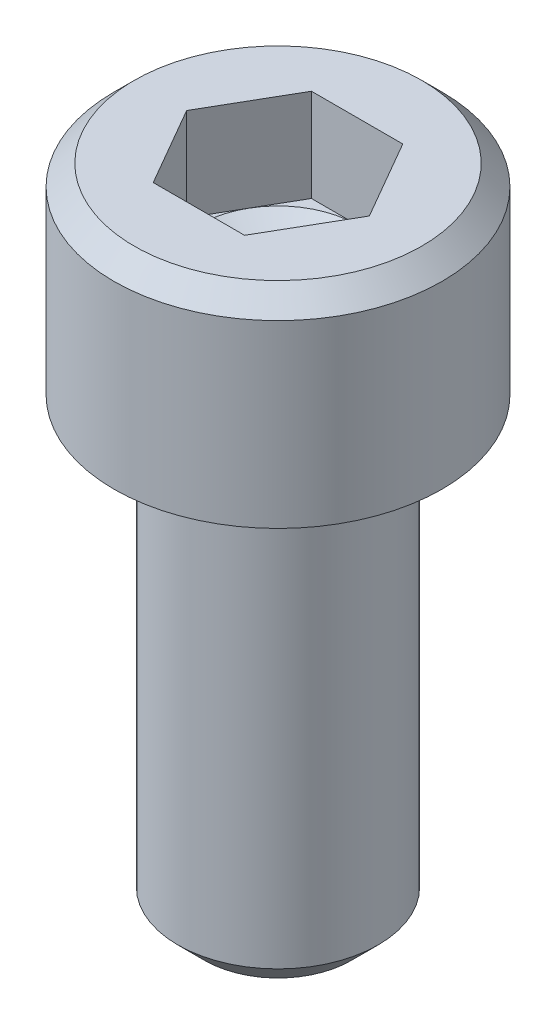
ISO-10303-21;
HEADER;
FILE_DESCRIPTION(('STEP AP214'),'2;1');
FILE_NAME('part.step','',(''),(''),'','','');
FILE_SCHEMA(('AUTOMOTIVE_DESIGN { 1 0 10303 214 1 1 1 1 }'));
ENDSEC;
DATA;
#1=APPLICATION_CONTEXT('core data for automotive mechanical design processes');
#2=APPLICATION_PROTOCOL_DEFINITION('international standard','automotive_design',2000,#1);
#3=PRODUCT_CONTEXT('',#1,'mechanical');
#4=PRODUCT('Part','Part','',(#3));
#5=PRODUCT_RELATED_PRODUCT_CATEGORY('part','',(#4));
#6=PRODUCT_DEFINITION_FORMATION('','',#4);
#7=PRODUCT_DEFINITION_CONTEXT('part definition',#1,'design');
#8=PRODUCT_DEFINITION('design','',#6,#7);
#9=PRODUCT_DEFINITION_SHAPE('','',#8);
#10=(LENGTH_UNIT() NAMED_UNIT(*) SI_UNIT(.MILLI.,.METRE.));
#11=(NAMED_UNIT(*) PLANE_ANGLE_UNIT() SI_UNIT($,.RADIAN.));
#12=(NAMED_UNIT(*) SI_UNIT($,.STERADIAN.) SOLID_ANGLE_UNIT());
#13=UNCERTAINTY_MEASURE_WITH_UNIT(LENGTH_MEASURE(1.E-05),#10,'distance_accuracy_value','');
#14=(GEOMETRIC_REPRESENTATION_CONTEXT(3) GLOBAL_UNCERTAINTY_ASSIGNED_CONTEXT((#13)) GLOBAL_UNIT_ASSIGNED_CONTEXT((#10,
#11,#12)) REPRESENTATION_CONTEXT('',''));
#15=CARTESIAN_POINT('',(0.,0.,0.));
#16=DIRECTION('',(0.,0.,1.));
#17=DIRECTION('',(1.,0.,0.));
#18=AXIS2_PLACEMENT_3D('',#15,#16,#17);
#19=CARTESIAN_POINT('',(0.,1.87960000005205,0.));
#20=DIRECTION('',(0.,1.,0.));
#21=DIRECTION('',(0.,0.,1.));
#22=AXIS2_PLACEMENT_3D('',#19,#20,#21);
#23=CONICAL_SURFACE('',#22,1.38430000009748,1.04719755120119);
#24=CARTESIAN_POINT('',(0.,1.08037402233663,5.6843418860808E-11));
#25=VERTEX_POINT('',#24);
#26=VERTEX_LOOP('',#25);
#27=FACE_BOUND('',#26,.T.);
#28=CARTESIAN_POINT('',(0.,1.87959999992078,0.));
#29=DIRECTION('',(0.,1.,0.));
#30=DIRECTION('',(0.,0.,1.));
#31=AXIS2_PLACEMENT_3D('',#28,#29,#30);
#32=CIRCLE('',#31,1.38429999987011);
#33=CARTESIAN_POINT('',(0.,1.87959999996039,-1.38429999993505));
#34=VERTEX_POINT('',#33);
#35=CARTESIAN_POINT('',(1.1988389664588,1.87959999996039,-0.692149999999999));
#36=VERTEX_POINT('',#35);
#37=EDGE_CURVE('E120',#34,#36,#32,.F.);
#38=ORIENTED_EDGE('',*,*,#37,.F.);
#39=CARTESIAN_POINT('',(0.,1.87959999998641,0.));
#40=DIRECTION('',(0.,1.,0.));
#41=DIRECTION('',(0.,0.,1.));
#42=AXIS2_PLACEMENT_3D('',#39,#40,#41);
#43=CIRCLE('',#42,1.3842999999838);
#44=CARTESIAN_POINT('',(-1.19883896645178,1.87959999999321,-0.692149999995951));
#45=VERTEX_POINT('',#44);
#46=EDGE_CURVE('E158',#45,#34,#43,.F.);
#47=ORIENTED_EDGE('',*,*,#46,.F.);
#48=CARTESIAN_POINT('',(0.,1.87959999998641,0.));
#49=DIRECTION('',(0.,1.,0.));
#50=DIRECTION('',(0.,0.,1.));
#51=AXIS2_PLACEMENT_3D('',#48,#49,#50);
#52=CIRCLE('',#51,1.3842999999838);
#53=CARTESIAN_POINT('',(-1.19883896645178,1.87960000001923,0.692149999995948));
#54=VERTEX_POINT('',#53);
#55=EDGE_CURVE('E155',#54,#45,#52,.F.);
#56=ORIENTED_EDGE('',*,*,#55,.F.);
#57=CARTESIAN_POINT('',(0.,1.87960000005205,0.));
#58=DIRECTION('',(0.,1.,0.));
#59=DIRECTION('',(0.,0.,1.));
#60=AXIS2_PLACEMENT_3D('',#57,#58,#59);
#61=CIRCLE('',#60,1.38430000009748);
#62=CARTESIAN_POINT('',(0.,1.87960000001923,1.38430000004064));
#63=VERTEX_POINT('',#62);
#64=EDGE_CURVE('E99',#63,#54,#61,.F.);
#65=ORIENTED_EDGE('',*,*,#64,.F.);
#66=CARTESIAN_POINT('',(0.,1.87959999998641,0.));
#67=DIRECTION('',(0.,1.,0.));
#68=DIRECTION('',(0.,0.,1.));
#69=AXIS2_PLACEMENT_3D('',#66,#67,#68);
#70=CIRCLE('',#69,1.3842999999838);
#71=CARTESIAN_POINT('',(1.19883896645178,1.87959999999321,0.692149999995949));
#72=VERTEX_POINT('',#71);
#73=EDGE_CURVE('E93',#72,#63,#70,.F.);
#74=ORIENTED_EDGE('',*,*,#73,.F.);
#75=CARTESIAN_POINT('',(0.,1.87959999998641,0.));
#76=DIRECTION('',(0.,1.,0.));
#77=DIRECTION('',(0.,0.,1.));
#78=AXIS2_PLACEMENT_3D('',#75,#76,#77);
#79=CIRCLE('',#78,1.3842999999838);
#80=EDGE_CURVE('E96',#36,#72,#79,.F.);
#81=ORIENTED_EDGE('',*,*,#80,.F.);
#82=EDGE_LOOP('',(#38,#47,#56,#65,#74,#81));
#83=FACE_BOUND('',#82,.T.);
#84=ADVANCED_FACE('F15',(#27,#83),#23,.F.);
#85=CARTESIAN_POINT('',(0.,1.8796,0.));
#86=DIRECTION('',(0.,1.,0.));
#87=DIRECTION('',(0.,0.,1.));
#88=AXIS2_PLACEMENT_3D('',#85,#86,#87);
#89=PLANE('',#88);
#90=DIRECTION('',(0.5,0.,-0.866025403784438));
#91=VECTOR('',#90,1.);
#92=CARTESIAN_POINT('',(0.799225977639199,1.8796,1.3843));
#93=LINE('',#92,#91);
#94=CARTESIAN_POINT('',(0.799225977639199,1.8796,1.3843));
#95=VERTEX_POINT('',#94);
#96=EDGE_CURVE('E105',#95,#72,#93,.T.);
#97=ORIENTED_EDGE('',*,*,#96,.T.);
#98=ORIENTED_EDGE('',*,*,#73,.T.);
#99=DIRECTION('',(1.,0.,0.));
#100=VECTOR('',#99,1.);
#101=CARTESIAN_POINT('',(-0.799225977639198,1.8796,1.3843));
#102=LINE('',#101,#100);
#103=EDGE_CURVE('E107',#63,#95,#102,.T.);
#104=ORIENTED_EDGE('',*,*,#103,.T.);
#105=EDGE_LOOP('',(#97,#98,#104));
#106=FACE_BOUND('',#105,.T.);
#107=ADVANCED_FACE('F106',(#106),#89,.T.);
#108=CARTESIAN_POINT('',(0.,1.8796,0.));
#109=DIRECTION('',(0.,1.,0.));
#110=DIRECTION('',(0.,0.,1.));
#111=AXIS2_PLACEMENT_3D('',#108,#109,#110);
#112=PLANE('',#111);
#113=DIRECTION('',(-0.499999999999999,0.,-0.866025403784439));
#114=VECTOR('',#113,1.);
#115=CARTESIAN_POINT('',(1.5984519552784,1.8796,0.));
#116=LINE('',#115,#114);
#117=CARTESIAN_POINT('',(1.5984519552784,1.8796,0.));
#118=VERTEX_POINT('',#117);
#119=EDGE_CURVE('E118',#118,#36,#116,.T.);
#120=ORIENTED_EDGE('',*,*,#119,.T.);
#121=ORIENTED_EDGE('',*,*,#80,.T.);
#122=DIRECTION('',(0.5,0.,-0.866025403784438));
#123=VECTOR('',#122,1.);
#124=CARTESIAN_POINT('',(0.799225977639199,1.8796,1.3843));
#125=LINE('',#124,#123);
#126=EDGE_CURVE('E112',#72,#118,#125,.T.);
#127=ORIENTED_EDGE('',*,*,#126,.T.);
#128=EDGE_LOOP('',(#120,#121,#127));
#129=FACE_BOUND('',#128,.T.);
#130=ADVANCED_FACE('F115',(#129),#112,.T.);
#131=CARTESIAN_POINT('',(0.,1.8796,0.));
#132=DIRECTION('',(0.,1.,0.));
#133=DIRECTION('',(0.,0.,1.));
#134=AXIS2_PLACEMENT_3D('',#131,#132,#133);
#135=PLANE('',#134);
#136=DIRECTION('',(-1.,0.,0.));
#137=VECTOR('',#136,1.);
#138=CARTESIAN_POINT('',(0.799225977639201,1.8796,-1.3843));
#139=LINE('',#138,#137);
#140=CARTESIAN_POINT('',(0.799225977639201,1.8796,-1.3843));
#141=VERTEX_POINT('',#140);
#142=EDGE_CURVE('E168',#141,#34,#139,.T.);
#143=ORIENTED_EDGE('',*,*,#142,.T.);
#144=ORIENTED_EDGE('',*,*,#37,.T.);
#145=DIRECTION('',(-0.499999999999999,0.,-0.866025403784439));
#146=VECTOR('',#145,1.);
#147=CARTESIAN_POINT('',(1.5984519552784,1.8796,0.));
#148=LINE('',#147,#146);
#149=EDGE_CURVE('E165',#36,#141,#148,.T.);
#150=ORIENTED_EDGE('',*,*,#149,.T.);
#151=EDGE_LOOP('',(#143,#144,#150));
#152=FACE_BOUND('',#151,.T.);
#153=ADVANCED_FACE('F164',(#152),#135,.T.);
#154=CARTESIAN_POINT('',(0.,1.8796,0.));
#155=DIRECTION('',(0.,1.,0.));
#156=DIRECTION('',(0.,0.,1.));
#157=AXIS2_PLACEMENT_3D('',#154,#155,#156);
#158=PLANE('',#157);
#159=DIRECTION('',(-0.5,0.,0.866025403784438));
#160=VECTOR('',#159,1.);
#161=CARTESIAN_POINT('',(-0.799225977639196,1.8796,-1.3843));
#162=LINE('',#161,#160);
#163=CARTESIAN_POINT('',(-0.799225977639196,1.8796,-1.3843));
#164=VERTEX_POINT('',#163);
#165=EDGE_CURVE('E183',#164,#45,#162,.T.);
#166=ORIENTED_EDGE('',*,*,#165,.T.);
#167=ORIENTED_EDGE('',*,*,#46,.T.);
#168=DIRECTION('',(-1.,0.,0.));
#169=VECTOR('',#168,1.);
#170=CARTESIAN_POINT('',(0.799225977639201,1.8796,-1.3843));
#171=LINE('',#170,#169);
#172=EDGE_CURVE('E184',#34,#164,#171,.T.);
#173=ORIENTED_EDGE('',*,*,#172,.T.);
#174=EDGE_LOOP('',(#166,#167,#173));
#175=FACE_BOUND('',#174,.T.);
#176=ADVANCED_FACE('F328',(#175),#158,.T.);
#177=CARTESIAN_POINT('',(0.,1.8796,0.));
#178=DIRECTION('',(0.,1.,0.));
#179=DIRECTION('',(0.,0.,1.));
#180=AXIS2_PLACEMENT_3D('',#177,#178,#179);
#181=PLANE('',#180);
#182=DIRECTION('',(0.5,0.,0.866025403784439));
#183=VECTOR('',#182,1.);
#184=CARTESIAN_POINT('',(-1.5984519552784,1.8796,0.));
#185=LINE('',#184,#183);
#186=CARTESIAN_POINT('',(-1.5984519552784,1.8796,0.));
#187=VERTEX_POINT('',#186);
#188=EDGE_CURVE('E196',#187,#54,#185,.T.);
#189=ORIENTED_EDGE('',*,*,#188,.T.);
#190=ORIENTED_EDGE('',*,*,#55,.T.);
#191=DIRECTION('',(-0.5,0.,0.866025403784438));
#192=VECTOR('',#191,1.);
#193=CARTESIAN_POINT('',(-0.799225977639196,1.8796,-1.3843));
#194=LINE('',#193,#192);
#195=EDGE_CURVE('E197',#45,#187,#194,.T.);
#196=ORIENTED_EDGE('',*,*,#195,.T.);
#197=EDGE_LOOP('',(#189,#190,#196));
#198=FACE_BOUND('',#197,.T.);
#199=ADVANCED_FACE('F324',(#198),#181,.T.);
#200=CARTESIAN_POINT('',(0.,1.8796,0.));
#201=DIRECTION('',(0.,1.,0.));
#202=DIRECTION('',(0.,0.,1.));
#203=AXIS2_PLACEMENT_3D('',#200,#201,#202);
#204=PLANE('',#203);
#205=DIRECTION('',(1.,0.,0.));
#206=VECTOR('',#205,1.);
#207=CARTESIAN_POINT('',(-0.799225977639198,1.8796,1.3843));
#208=LINE('',#207,#206);
#209=CARTESIAN_POINT('',(-0.799225977639198,1.8796,1.3843));
#210=VERTEX_POINT('',#209);
#211=EDGE_CURVE('E139',#210,#63,#208,.T.);
#212=ORIENTED_EDGE('',*,*,#211,.T.);
#213=ORIENTED_EDGE('',*,*,#64,.T.);
#214=DIRECTION('',(0.5,0.,0.866025403784439));
#215=VECTOR('',#214,1.);
#216=CARTESIAN_POINT('',(-1.5984519552784,1.8796,0.));
#217=LINE('',#216,#215);
#218=EDGE_CURVE('E215',#54,#210,#217,.T.);
#219=ORIENTED_EDGE('',*,*,#218,.T.);
#220=EDGE_LOOP('',(#212,#213,#219));
#221=FACE_BOUND('',#220,.T.);
#222=ADVANCED_FACE('F320',(#221),#204,.T.);
#223=CARTESIAN_POINT('',(-0.799225977639198,3.5052,1.3843));
#224=DIRECTION('',(0.,0.,1.));
#225=DIRECTION('',(1.,0.,0.));
#226=AXIS2_PLACEMENT_3D('',#223,#224,#225);
#227=PLANE('',#226);
#228=DIRECTION('',(1.,0.,0.));
#229=VECTOR('',#228,1.);
#230=CARTESIAN_POINT('',(0.,3.5052,1.3843));
#231=LINE('',#230,#229);
#232=CARTESIAN_POINT('',(-0.799225977639198,3.5052,1.3843));
#233=VERTEX_POINT('',#232);
#234=CARTESIAN_POINT('',(0.799225977639199,3.5052,1.3843));
#235=VERTEX_POINT('',#234);
#236=EDGE_CURVE('E210',#233,#235,#231,.T.);
#237=ORIENTED_EDGE('',*,*,#236,.T.);
#238=DIRECTION('',(0.,1.,0.));
#239=VECTOR('',#238,1.);
#240=CARTESIAN_POINT('',(0.799225977639199,3.5052,1.3843));
#241=LINE('',#240,#239);
#242=EDGE_CURVE('E125',#235,#95,#241,.F.);
#243=ORIENTED_EDGE('',*,*,#242,.T.);
#244=ORIENTED_EDGE('',*,*,#103,.F.);
#245=ORIENTED_EDGE('',*,*,#211,.F.);
#246=DIRECTION('',(0.,1.,0.));
#247=VECTOR('',#246,1.);
#248=CARTESIAN_POINT('',(-0.799225977639198,3.5052,1.3843));
#249=LINE('',#248,#247);
#250=EDGE_CURVE('E211',#210,#233,#249,.T.);
#251=ORIENTED_EDGE('',*,*,#250,.T.);
#252=EDGE_LOOP('',(#237,#243,#244,#245,#251));
#253=FACE_BOUND('',#252,.T.);
#254=ADVANCED_FACE('F317',(#253),#227,.F.);
#255=CARTESIAN_POINT('',(0.799225977639199,3.5052,1.3843));
#256=DIRECTION('',(0.866025403784438,0.,0.5));
#257=DIRECTION('',(0.5,0.,-0.866025403784438));
#258=AXIS2_PLACEMENT_3D('',#255,#256,#257);
#259=PLANE('',#258);
#260=DIRECTION('',(0.5,0.,-0.866025403784438));
#261=VECTOR('',#260,1.);
#262=CARTESIAN_POINT('',(0.799225977639199,3.5052,1.3843));
#263=LINE('',#262,#261);
#264=CARTESIAN_POINT('',(1.5984519552784,3.5052,0.));
#265=VERTEX_POINT('',#264);
#266=EDGE_CURVE('E227',#235,#265,#263,.T.);
#267=ORIENTED_EDGE('',*,*,#266,.T.);
#268=DIRECTION('',(0.,1.,0.));
#269=VECTOR('',#268,1.);
#270=CARTESIAN_POINT('',(1.5984519552784,3.5052,0.));
#271=LINE('',#270,#269);
#272=EDGE_CURVE('E124',#265,#118,#271,.F.);
#273=ORIENTED_EDGE('',*,*,#272,.T.);
#274=ORIENTED_EDGE('',*,*,#126,.F.);
#275=ORIENTED_EDGE('',*,*,#96,.F.);
#276=ORIENTED_EDGE('',*,*,#242,.F.);
#277=EDGE_LOOP('',(#267,#273,#274,#275,#276));
#278=FACE_BOUND('',#277,.T.);
#279=ADVANCED_FACE('F122',(#278),#259,.F.);
#280=CARTESIAN_POINT('',(1.5984519552784,3.5052,0.));
#281=DIRECTION('',(0.866025403784439,0.,-0.499999999999999));
#282=DIRECTION('',(-0.499999999999999,0.,-0.866025403784439));
#283=AXIS2_PLACEMENT_3D('',#280,#281,#282);
#284=PLANE('',#283);
#285=DIRECTION('',(-0.499999999999999,0.,-0.866025403784439));
#286=VECTOR('',#285,1.);
#287=CARTESIAN_POINT('',(1.5984519552784,3.5052,0.));
#288=LINE('',#287,#286);
#289=CARTESIAN_POINT('',(0.799225977639201,3.5052,-1.3843));
#290=VERTEX_POINT('',#289);
#291=EDGE_CURVE('E229',#265,#290,#288,.T.);
#292=ORIENTED_EDGE('',*,*,#291,.T.);
#293=DIRECTION('',(0.,1.,0.));
#294=VECTOR('',#293,1.);
#295=CARTESIAN_POINT('',(0.799225977639201,3.5052,-1.3843));
#296=LINE('',#295,#294);
#297=EDGE_CURVE('E172',#290,#141,#296,.F.);
#298=ORIENTED_EDGE('',*,*,#297,.T.);
#299=ORIENTED_EDGE('',*,*,#149,.F.);
#300=ORIENTED_EDGE('',*,*,#119,.F.);
#301=ORIENTED_EDGE('',*,*,#272,.F.);
#302=EDGE_LOOP('',(#292,#298,#299,#300,#301));
#303=FACE_BOUND('',#302,.T.);
#304=ADVANCED_FACE('F170',(#303),#284,.F.);
#305=CARTESIAN_POINT('',(0.799225977639201,3.5052,-1.3843));
#306=DIRECTION('',(0.,0.,-1.));
#307=DIRECTION('',(-1.,0.,0.));
#308=AXIS2_PLACEMENT_3D('',#305,#306,#307);
#309=PLANE('',#308);
#310=DIRECTION('',(1.,0.,0.));
#311=VECTOR('',#310,1.);
#312=CARTESIAN_POINT('',(0.,3.5052,-1.3843));
#313=LINE('',#312,#311);
#314=CARTESIAN_POINT('',(-0.799225977639196,3.5052,-1.3843));
#315=VERTEX_POINT('',#314);
#316=EDGE_CURVE('E231',#290,#315,#313,.F.);
#317=ORIENTED_EDGE('',*,*,#316,.T.);
#318=DIRECTION('',(0.,1.,0.));
#319=VECTOR('',#318,1.);
#320=CARTESIAN_POINT('',(-0.799225977639196,3.5052,-1.3843));
#321=LINE('',#320,#319);
#322=EDGE_CURVE('E193',#315,#164,#321,.F.);
#323=ORIENTED_EDGE('',*,*,#322,.T.);
#324=ORIENTED_EDGE('',*,*,#172,.F.);
#325=ORIENTED_EDGE('',*,*,#142,.F.);
#326=ORIENTED_EDGE('',*,*,#297,.F.);
#327=EDGE_LOOP('',(#317,#323,#324,#325,#326));
#328=FACE_BOUND('',#327,.T.);
#329=ADVANCED_FACE('F308',(#328),#309,.F.);
#330=CARTESIAN_POINT('',(-0.799225977639196,3.5052,-1.3843));
#331=DIRECTION('',(-0.866025403784438,0.,-0.5));
#332=DIRECTION('',(-0.5,0.,0.866025403784438));
#333=AXIS2_PLACEMENT_3D('',#330,#331,#332);
#334=PLANE('',#333);
#335=DIRECTION('',(-0.500000000000001,0.,0.866025403784438));
#336=VECTOR('',#335,1.);
#337=CARTESIAN_POINT('',(-0.799225977639196,3.5052,-1.3843));
#338=LINE('',#337,#336);
#339=CARTESIAN_POINT('',(-1.5984519552784,3.5052,0.));
#340=VERTEX_POINT('',#339);
#341=EDGE_CURVE('E233',#315,#340,#338,.T.);
#342=ORIENTED_EDGE('',*,*,#341,.T.);
#343=DIRECTION('',(0.,1.,0.));
#344=VECTOR('',#343,1.);
#345=CARTESIAN_POINT('',(-1.5984519552784,3.5052,0.));
#346=LINE('',#345,#344);
#347=EDGE_CURVE('E207',#340,#187,#346,.F.);
#348=ORIENTED_EDGE('',*,*,#347,.T.);
#349=ORIENTED_EDGE('',*,*,#195,.F.);
#350=ORIENTED_EDGE('',*,*,#165,.F.);
#351=ORIENTED_EDGE('',*,*,#322,.F.);
#352=EDGE_LOOP('',(#342,#348,#349,#350,#351));
#353=FACE_BOUND('',#352,.T.);
#354=ADVANCED_FACE('F304',(#353),#334,.F.);
#355=CARTESIAN_POINT('',(-1.5984519552784,3.5052,0.));
#356=DIRECTION('',(-0.866025403784439,0.,0.5));
#357=DIRECTION('',(0.5,0.,0.866025403784439));
#358=AXIS2_PLACEMENT_3D('',#355,#356,#357);
#359=PLANE('',#358);
#360=DIRECTION('',(0.5,0.,0.866025403784439));
#361=VECTOR('',#360,1.);
#362=CARTESIAN_POINT('',(-1.5984519552784,3.5052,0.));
#363=LINE('',#362,#361);
#364=EDGE_CURVE('E153',#340,#233,#363,.T.);
#365=ORIENTED_EDGE('',*,*,#364,.T.);
#366=ORIENTED_EDGE('',*,*,#250,.F.);
#367=ORIENTED_EDGE('',*,*,#218,.F.);
#368=ORIENTED_EDGE('',*,*,#188,.F.);
#369=ORIENTED_EDGE('',*,*,#347,.F.);
#370=EDGE_LOOP('',(#365,#366,#367,#368,#369));
#371=FACE_BOUND('',#370,.T.);
#372=ADVANCED_FACE('F300',(#371),#359,.F.);
#373=CARTESIAN_POINT('',(0.,3.5052,0.));
#374=DIRECTION('',(0.,-1.,0.));
#375=DIRECTION('',(0.,0.,-1.));
#376=AXIS2_PLACEMENT_3D('',#373,#374,#375);
#377=PLANE('',#376);
#378=ORIENTED_EDGE('',*,*,#341,.F.);
#379=ORIENTED_EDGE('',*,*,#316,.F.);
#380=ORIENTED_EDGE('',*,*,#291,.F.);
#381=ORIENTED_EDGE('',*,*,#266,.F.);
#382=ORIENTED_EDGE('',*,*,#236,.F.);
#383=ORIENTED_EDGE('',*,*,#364,.F.);
#384=EDGE_LOOP('',(#378,#379,#380,#381,#382,#383));
#385=FACE_BOUND('',#384,.T.);
#386=CARTESIAN_POINT('',(0.,3.50520000006327,0.));
#387=DIRECTION('',(0.,-1.,0.));
#388=DIRECTION('',(0.,0.,-1.));
#389=AXIS2_PLACEMENT_3D('',#386,#387,#388);
#390=CIRCLE('',#389,2.5145999999836);
#391=CARTESIAN_POINT('',(0.,3.50520000006327,-2.5145999999836));
#392=VERTEX_POINT('',#391);
#393=EDGE_CURVE('E150',#392,#392,#390,.T.);
#394=ORIENTED_EDGE('',*,*,#393,.F.);
#395=EDGE_LOOP('',(#394));
#396=FACE_BOUND('',#395,.T.);
#397=ADVANCED_FACE('F296',(#385,#396),#377,.F.);
#398=CARTESIAN_POINT('',(0.,3.14960000002884,0.));
#399=DIRECTION('',(0.,-1.,0.));
#400=DIRECTION('',(0.,0.,-1.));
#401=AXIS2_PLACEMENT_3D('',#398,#399,#400);
#402=CONICAL_SURFACE('',#401,2.87020000001803,0.785398163397448);
#403=CARTESIAN_POINT('',(0.,3.1496,0.));
#404=DIRECTION('',(0.,-1.,0.));
#405=DIRECTION('',(0.,0.,-1.));
#406=AXIS2_PLACEMENT_3D('',#403,#404,#405);
#407=CIRCLE('',#406,2.8702);
#408=CARTESIAN_POINT('',(0.,3.1496,-2.8702));
#409=VERTEX_POINT('',#408);
#410=EDGE_CURVE('E149',#409,#409,#407,.T.);
#411=ORIENTED_EDGE('',*,*,#410,.F.);
#412=EDGE_LOOP('',(#411));
#413=FACE_BOUND('',#412,.T.);
#414=ORIENTED_EDGE('',*,*,#393,.T.);
#415=EDGE_LOOP('',(#414));
#416=FACE_BOUND('',#415,.T.);
#417=ADVANCED_FACE('F292',(#413,#416),#402,.T.);
#418=CARTESIAN_POINT('',(0.,4.077335,0.));
#419=DIRECTION('',(0.,-1.,0.));
#420=DIRECTION('',(0.,0.,-1.));
#421=AXIS2_PLACEMENT_3D('',#418,#419,#420);
#422=CYLINDRICAL_SURFACE('',#421,2.8702);
#423=CARTESIAN_POINT('',(0.,0.,0.));
#424=DIRECTION('',(0.,-1.,0.));
#425=DIRECTION('',(0.,0.,-1.));
#426=AXIS2_PLACEMENT_3D('',#423,#424,#425);
#427=CIRCLE('',#426,2.8702);
#428=CARTESIAN_POINT('',(0.,0.,-2.8702));
#429=VERTEX_POINT('',#428);
#430=EDGE_CURVE('E146',#429,#429,#427,.T.);
#431=ORIENTED_EDGE('',*,*,#430,.F.);
#432=EDGE_LOOP('',(#431));
#433=FACE_BOUND('',#432,.T.);
#434=ORIENTED_EDGE('',*,*,#410,.T.);
#435=EDGE_LOOP('',(#434));
#436=FACE_BOUND('',#435,.T.);
#437=ADVANCED_FACE('F288',(#433,#436),#422,.T.);
#438=CARTESIAN_POINT('',(0.,-7.9375,0.));
#439=DIRECTION('',(0.,-1.,0.));
#440=DIRECTION('',(0.,0.,-1.));
#441=AXIS2_PLACEMENT_3D('',#438,#439,#440);
#442=PLANE('',#441);
#443=CARTESIAN_POINT('',(0.,-7.93750000002547,0.));
#444=DIRECTION('',(0.,1.,0.));
#445=DIRECTION('',(0.,0.,1.));
#446=AXIS2_PLACEMENT_3D('',#443,#444,#445);
#447=CIRCLE('',#446,1.28015999996478);
#448=CARTESIAN_POINT('',(0.,-7.93750000002547,1.28015999996478));
#449=VERTEX_POINT('',#448);
#450=EDGE_CURVE('E142',#449,#449,#447,.T.);
#451=ORIENTED_EDGE('',*,*,#450,.F.);
#452=EDGE_LOOP('',(#451));
#453=FACE_BOUND('',#452,.T.);
#454=ADVANCED_FACE('F277',(#453),#442,.T.);
#455=CARTESIAN_POINT('',(0.,0.,0.));
#456=DIRECTION('',(0.,-1.,0.));
#457=DIRECTION('',(0.,0.,-1.));
#458=AXIS2_PLACEMENT_3D('',#455,#456,#457);
#459=PLANE('',#458);
#460=CARTESIAN_POINT('',(-2.0066,0.,0.));
#461=CARTESIAN_POINT('',(-2.00657674795477,-1.02987322868103E-09,-0.0210535453836888));
#462=CARTESIAN_POINT('',(-2.00622815317092,-3.28270234331897E-09,-0.0421067214151488));
#463=CARTESIAN_POINT('',(-2.0048811989517,-7.11117959561256E-09,-0.0841913443053813));
#464=CARTESIAN_POINT('',(-2.00388286833117,-8.68685775877969E-09,-0.105222792086344));
#465=CARTESIAN_POINT('',(-2.00123739445825,-8.03859394237303E-09,-0.147244308043756));
#466=CARTESIAN_POINT('',(-1.99959026759685,-5.81474794807904E-09,-0.16823437725212));
#467=CARTESIAN_POINT('',(-1.99564844990729,-9.30315128877116E-10,-0.210153505177709));
#468=CARTESIAN_POINT('',(-1.99335376308009,1.73026899760534E-09,-0.231082564271078));
#469=CARTESIAN_POINT('',(-1.98812042069833,-3.30203769784527E-09,-0.272860201859723));
#470=CARTESIAN_POINT('',(-1.98518175683406,-1.09950621266378E-08,-0.293708779312952));
#471=CARTESIAN_POINT('',(-1.97865784703102,-4.46982791273633E-08,-0.335305664420834));
#472=CARTESIAN_POINT('',(-1.97507258041409,-7.07090575725484E-08,-0.356053968846992));
#473=CARTESIAN_POINT('',(-1.97020152960264,-1.42926104478227E-07,-0.381914968927608));
#474=CARTESIAN_POINT('',(-1.96920779513382,-1.59355672164636E-07,-0.387083706135684));
#475=CARTESIAN_POINT('',(-1.96663693460487,-1.90968976662609E-07,-0.400125398277151));
#476=CARTESIAN_POINT('',(-1.96502766009135,-2.00960847295408E-07,-0.407992049031747));
#477=CARTESIAN_POINT('',(-1.95960284683241,-2.18405370153509E-07,-0.433667817878984));
#478=CARTESIAN_POINT('',(-1.95557776885798,-2.06564595586332E-07,-0.451432732885808));
#479=CARTESIAN_POINT('',(-1.94502916466347,-1.71278707842198E-07,-0.495186172860747));
#480=CARTESIAN_POINT('',(-1.93822180607698,-1.44994717166113E-07,-0.521106969519364));
#481=CARTESIAN_POINT('',(-1.92754178238934,-1.06622923101906E-07,-0.558669722683704));
#482=CARTESIAN_POINT('',(-1.92408017493624,-9.45682034763325E-08,-0.570430290676044));
#483=CARTESIAN_POINT('',(-1.91443920677518,-6.47820304016461E-08,-0.602108687273396));
#484=CARTESIAN_POINT('',(-1.90805591894326,-4.89958367324419E-08,-0.62196489634165));
#485=CARTESIAN_POINT('',(-1.89322696195701,-2.16570692512158E-08,-0.6657440113875));
#486=CARTESIAN_POINT('',(-1.88463391007707,-1.17598048123285E-08,-0.689617144636188));
#487=CARTESIAN_POINT('',(-1.87005888082923,-2.75229019226935E-09,-0.727821938101784));
#488=CARTESIAN_POINT('',(-1.86435762946484,-9.46506409186385E-10,-0.742261311004643));
#489=CARTESIAN_POINT('',(-1.8569571643915,-1.98452065742484E-10,-0.760403034197268));
#490=CARTESIAN_POINT('',(-1.85540869056698,-1.26458943328944E-10,-0.764167166905696));
#491=CARTESIAN_POINT('',(-1.84982143640068,4.47138408935015E-11,-0.777638146790325));
#492=CARTESIAN_POINT('',(-1.84572094640862,6.5112002128641E-12,-0.787319460403763));
#493=CARTESIAN_POINT('',(-1.83319343018424,-1.58719486001751E-11,-0.8162650256954));
#494=CARTESIAN_POINT('',(-1.82453998858113,9.2159889624457E-11,-0.835431833552913));
#495=CARTESIAN_POINT('',(-1.80664368504906,-3.34783013206927E-10,-0.873487528804415));
#496=CARTESIAN_POINT('',(-1.79740083080505,-8.69749372256401E-10,-0.892376419818028));
#497=CARTESIAN_POINT('',(-1.7783327671823,-5.28964813308161E-09,-0.929858040522434));
#498=CARTESIAN_POINT('',(-1.76850755818313,-9.17457835141041E-09,-0.948450770406252));
#499=CARTESIAN_POINT('',(-1.74828526439013,-2.69615032211072E-08,-0.985322860463001));
#500=CARTESIAN_POINT('',(-1.73788817288871,-4.08636153865207E-08,-1.0036022169571));
#501=CARTESIAN_POINT('',(-1.71652929081971,-8.19274780316847E-08,-1.03982855952264));
#502=CARTESIAN_POINT('',(-1.70556748664128,-1.09089548239784E-07,-1.05777553756884));
#503=CARTESIAN_POINT('',(-1.68590779857202,-1.92038538961032E-07,-1.08888228104149));
#504=CARTESIAN_POINT('',(-1.67732893012993,-2.38973155826874E-07,-1.10211731605582));
#505=CARTESIAN_POINT('',(-1.66737397427836,-2.85569048380499E-07,-1.11706811636007));
#506=CARTESIAN_POINT('',(-1.66615644540053,-2.91137025433598E-07,-1.11888988203999));
#507=CARTESIAN_POINT('',(-1.65710976800061,-3.251492220666E-07,-1.13236982426601));
#508=CARTESIAN_POINT('',(-1.64913968443748,-3.14428699606279E-07,-1.14393364142148));
#509=CARTESIAN_POINT('',(-1.6280889475509,-2.78775875892855E-07,-1.17379137340659));
#510=CARTESIAN_POINT('',(-1.61481719150915,-2.49174101557778E-07,-1.19195073228609));
#511=CARTESIAN_POINT('',(-1.58517803272265,-1.78799760062337E-07,-1.23108761543351));
#512=CARTESIAN_POINT('',(-1.56868858527346,-1.36974271482056E-07,-1.25197272345078));
#513=CARTESIAN_POINT('',(-1.53110609367447,-6.28657621700323E-08,-1.29767441875975));
#514=CARTESIAN_POINT('',(-1.50980913790186,-3.48180722527908E-08,-1.32232388307862));
#515=CARTESIAN_POINT('',(-1.47408305247002,-8.75549677614937E-09,-1.3617026947383));
#516=CARTESIAN_POINT('',(-1.46000368172331,-3.49436515205118E-09,-1.37675104820152));
#517=CARTESIAN_POINT('',(-1.43684471589307,-1.06894253846871E-10,-1.4007647105988));
#518=CARTESIAN_POINT('',(-1.42790344032393,-2.62057990142239E-11,-1.40986373433866));
#519=CARTESIAN_POINT('',(-1.40400254483371,3.30191074214384E-11,-1.43374286826482));
#520=CARTESIAN_POINT('',(-1.38890017677361,-8.86190779095147E-11,-1.44838068566973));
#521=CARTESIAN_POINT('',(-1.35824599394922,3.53217776602966E-12,-1.4771769584308));
#522=CARTESIAN_POINT('',(-1.34269418779438,2.17315197602431E-10,-1.4913354229582));
#523=CARTESIAN_POINT('',(-1.31115938241099,-1.31940176197063E-09,-1.51916354734923));
#524=CARTESIAN_POINT('',(-1.29517638607931,-3.06988854801023E-09,-1.53283321049533));
#525=CARTESIAN_POINT('',(-1.26279328654894,-1.24287031660242E-08,-1.5596694338315));
#526=CARTESIAN_POINT('',(-1.24639318096924,-2.00370644439671E-08,-1.57283599114859));
#527=CARTESIAN_POINT('',(-1.21319259449835,-5.00092750128227E-08,-1.59865472137272));
#528=CARTESIAN_POINT('',(-1.19639210635177,-7.23733918908186E-08,-1.61130688494712));
#529=CARTESIAN_POINT('',(-1.1624033797944,-1.33475399336209E-07,-1.63608113370562));
#530=CARTESIAN_POINT('',(-1.14521512955012,-1.72213790245397E-07,-1.64820320267937));
#531=CARTESIAN_POINT('',(-1.12350556118374,-2.5590939186804E-07,-1.66302548597681));
#532=CARTESIAN_POINT('',(-1.11915222956514,-2.74413149122719E-07,-1.66597356454396));
#533=CARTESIAN_POINT('',(-1.10795992564871,-3.08826135172452E-07,-1.67347764496279));
#534=CARTESIAN_POINT('',(-1.10110136235172,-3.1740997760186E-07,-1.67800449102467));
#535=CARTESIAN_POINT('',(-1.07888494827042,-3.26316941285496E-07,-1.69245925418981));
#536=CARTESIAN_POINT('',(-1.06341063498823,-3.03628853977139E-07,-1.70220830679274));
#537=CARTESIAN_POINT('',(-1.02504900254242,-2.42168185231604E-07,-1.72564219322325));
#538=CARTESIAN_POINT('',(-1.00201272848581,-2.007882217182E-07,-1.73908443143617));
#539=CARTESIAN_POINT('',(-0.968094573341908,-1.43447944507211E-07,-1.75797313042803));
#540=CARTESIAN_POINT('',(-0.95741783300332,-1.25904961339837E-07,-1.76379131985225));
#541=CARTESIAN_POINT('',(-0.929427155169496,-8.45679112686229E-08,-1.77871595587886));
#542=CARTESIAN_POINT('',(-0.912030276427905,-6.34716592759383E-08,-1.78766750581178));
#543=CARTESIAN_POINT('',(-0.872411014853843,-2.66966733465684E-08,-1.80732900871362));
#544=CARTESIAN_POINT('',(-0.850113762049958,-1.38670545520223E-08,-1.81788846301931));
#545=CARTESIAN_POINT('',(-0.812587995479031,-2.47782715904388E-09,-1.83482330763336));
#546=CARTESIAN_POINT('',(-0.797462039956761,-6.00920670482858E-10,-1.84142693706946));
#547=CARTESIAN_POINT('',(-0.777478324914815,2.52963507975057E-12,-1.84986936015123));
#548=CARTESIAN_POINT('',(-0.772689218697075,6.65072768628243E-12,-1.85187147480032));
#549=CARTESIAN_POINT('',(-0.758176468026641,-1.71200847915227E-11,-1.85787532906941));
#550=CARTESIAN_POINT('',(-0.748429888756723,-8.21832909326729E-11,-1.86182174191666));
#551=CARTESIAN_POINT('',(-0.719100035703225,-1.44261964795E-10,-1.87343191649729));
#552=CARTESIAN_POINT('',(-0.699425706089054,-8.18579236780538E-12,-1.88086702098394));
#553=CARTESIAN_POINT('',(-0.65985673266515,2.51653172115643E-12,-1.89512374008074));
#554=CARTESIAN_POINT('',(-0.639962091984539,-1.22853607967726E-10,-1.90194536339175));
#555=CARTESIAN_POINT('',(-0.5999704968968,-3.43442649343189E-09,-1.9149675189352));
#556=CARTESIAN_POINT('',(-0.579873542783615,-6.62062479274827E-09,-1.92116805206987));
#557=CARTESIAN_POINT('',(-0.539496855116592,-2.2869919242062E-08,-1.93294319746734));
#558=CARTESIAN_POINT('',(-0.519217119503749,-3.59331267927449E-08,-1.93851780266961));
#559=CARTESIAN_POINT('',(-0.478493372885721,-7.55389428743474E-08,-1.94903274863988));
#560=CARTESIAN_POINT('',(-0.45804935794807,-1.02081875030318E-07,-1.95397307417634));
#561=CARTESIAN_POINT('',(-0.422147835579965,-1.84368524108583E-07,-1.96206929951789));
#562=CARTESIAN_POINT('',(-0.40672126069677,-2.31154665360021E-07,-1.96536256049036));
#563=CARTESIAN_POINT('',(-0.389100804740298,-2.78135091365043E-07,-1.96889758979212));
#564=CARTESIAN_POINT('',(-0.386944091454524,-2.83775498220051E-07,-1.96932641564649));
#565=CARTESIAN_POINT('',(-0.370990586511601,-3.18271571904273E-07,-1.9724663437446));
#566=CARTESIAN_POINT('',(-0.357160757173938,-3.0823017327172E-07,-1.97501055725626));
#567=CARTESIAN_POINT('',(-0.321149630115314,-2.74127664208642E-07,-1.98123944628555));
#568=CARTESIAN_POINT('',(-0.298928429987697,-2.45271496354213E-07,-1.98469428295414));
#569=CARTESIAN_POINT('',(-0.250321446368958,-1.76349016072894E-07,-1.9914054733912));
#570=CARTESIAN_POINT('',(-0.223914815972968,-1.35198101939881E-07,-1.99451087515576));
#571=CARTESIAN_POINT('',(-0.164816863404308,-6.18313406621171E-08,-2.00027233097381));
#572=CARTESIAN_POINT('',(-0.132098313383777,-3.39477935737586E-08,-2.00265399220273));
#573=CARTESIAN_POINT('',(-0.0787756645733558,-8.26173847812965E-09,-2.00522860581467));
#574=CARTESIAN_POINT('',(-0.0581936508966942,-3.12700555240628E-09,-2.00590620599958));
#575=CARTESIAN_POINT('',(-0.0250723204734936,-2.69915774905352E-12,-2.00649488476441));
#576=CARTESIAN_POINT('',(-0.0125362535323584,-3.84885776240088E-12,-2.00660212060184));
#577=CARTESIAN_POINT('',(0.0210281014451863,-7.5447652674037E-11,-2.00658588839315));
#578=CARTESIAN_POINT('',(0.0420567191896618,-1.92311527313847E-10,-2.0062569400662));
#579=CARTESIAN_POINT('',(0.084092798765319,-1.08349722158355E-10,-2.00494241369027));
#580=CARTESIAN_POINT('',(0.105100261001589,9.24697542294119E-11,-2.00395684846329));
#581=CARTESIAN_POINT('',(0.147074346186977,-5.87433516574371E-10,-2.00133492621802));
#582=CARTESIAN_POINT('',(0.168040969422576,-1.46814864932867E-09,-1.99969857378159));
#583=CARTESIAN_POINT('',(0.209913736574642,-1.08396294491389E-08,-1.9957766220143));
#584=CARTESIAN_POINT('',(0.230819880161141,-1.93304365574842E-08,-1.99349101914794));
#585=CARTESIAN_POINT('',(0.272550292369942,-4.2540293684807E-08,-1.98826803356716));
#586=CARTESIAN_POINT('',(0.293374559517453,-5.72594553774052E-08,-1.98533063916666));
#587=CARTESIAN_POINT('',(0.340120845347027,-1.41931730058366E-07,-1.9780126999416));
#588=CARTESIAN_POINT('',(0.366015700185954,-2.24774149202504E-07,-1.97345495507055));
#589=CARTESIAN_POINT('',(0.399808954504522,-2.87398775420298E-07,-1.9667736697045));
#590=CARTESIAN_POINT('',(0.40780559857794,-2.98857095782321E-07,-1.96513846390474));
#591=CARTESIAN_POINT('',(0.433663972920404,-3.13418209487724E-07,-1.95967175987335));
#592=CARTESIAN_POINT('',(0.451481046596413,-2.88609328546254E-07,-1.95562774293405));
#593=CARTESIAN_POINT('',(0.495201862776217,-2.26347276163641E-07,-1.94507016604226));
#594=CARTESIAN_POINT('',(0.521039100777667,-1.88347256014791E-07,-1.93827878756382));
#595=CARTESIAN_POINT('',(0.558453230720759,-1.34165468713197E-07,-1.92763367085638));
#596=CARTESIAN_POINT('',(0.570148280362737,-1.17350703355644E-07,-1.92418951661571));
#597=CARTESIAN_POINT('',(0.600332119808305,-7.8283565784849E-08,-1.91500061227065));
#598=CARTESIAN_POINT('',(0.618771918471314,-5.8647932208996E-08,-1.90909396204707));
#599=CARTESIAN_POINT('',(0.660396539872258,-2.441351037822E-08,-1.89509608121071));
#600=CARTESIAN_POINT('',(0.683527400235306,-1.25785648047403E-08,-1.88684385327238));
#601=CARTESIAN_POINT('',(0.722077039647589,-2.14429944286983E-09,-1.87229159388589));
#602=CARTESIAN_POINT('',(0.737581755619332,-5.10943074487954E-10,-1.86621813598699));
#603=CARTESIAN_POINT('',(0.757979381340572,9.05843981866536E-12,-1.85794403566193));
#604=CARTESIAN_POINT('',(0.762939989730585,7.13763412899063E-12,-1.8559094271021));
#605=CARTESIAN_POINT('',(0.777605274100064,-1.75657886575079E-11,-1.84982842430048));
#606=CARTESIAN_POINT('',(0.787287512316865,-5.86236365001032E-11,-1.84572781108379));
#607=CARTESIAN_POINT('',(0.816236000602323,-5.03062980797386E-11,-1.83320023068297));
#608=CARTESIAN_POINT('',(0.835404950618538,1.30543426794014E-10,-1.82454715575945));
#609=CARTESIAN_POINT('',(0.873464821006357,-1.9187990381338E-10,-1.80665122850014));
#610=CARTESIAN_POINT('',(0.892355744900073,-6.95144285191235E-10,-1.79740838364364));
#611=CARTESIAN_POINT('',(0.929841331116051,-4.90151433576339E-09,-1.77834011255007));
#612=CARTESIAN_POINT('',(0.948435993535683,-8.60461895327029E-09,-1.76851468650448));
#613=CARTESIAN_POINT('',(0.98531227068529,-2.76354093881292E-08,-1.74829239853424));
#614=CARTESIAN_POINT('',(1.00359388164938,-4.29632349458677E-08,-1.73789552974169));
#615=CARTESIAN_POINT('',(1.03982331575928,-8.27095840884123E-08,-1.71653475409388));
#616=CARTESIAN_POINT('',(1.05777113075989,-1.07128329202611E-07,-1.70557083342619));
#617=CARTESIAN_POINT('',(1.08888378126388,-2.01173078664069E-07,-1.68591455514355));
#618=CARTESIAN_POINT('',(1.10212277656803,-2.57973198050568E-07,-1.67733943432122));
#619=CARTESIAN_POINT('',(1.12881756866945,-3.18557759415499E-07,-1.65954888012512));
#620=CARTESIAN_POINT('',(1.14226547369643,-3.2047744477436E-07,-1.65032159245285));
#621=CARTESIAN_POINT('',(1.17396700052891,-2.96967310742569E-07,-1.62797603142719));
#622=CARTESIAN_POINT('',(1.19211401417272,-2.60916074815968E-07,-1.61470636335158));
#623=CARTESIAN_POINT('',(1.23118887102984,-1.83706565784592E-07,-1.58510451562985));
#624=CARTESIAN_POINT('',(1.25202595072794,-1.42804111452386E-07,-1.56865255572084));
#625=CARTESIAN_POINT('',(1.29790797888578,-6.76421410362185E-08,-1.53092207367093));
#626=CARTESIAN_POINT('',(1.3227749366673,-3.72767168229299E-08,-1.50942629685124));
#627=CARTESIAN_POINT('',(1.36234235159306,-9.35619926550321E-09,-1.4734953069034));
#628=CARTESIAN_POINT('',(1.37737201397159,-3.78371417858392E-09,-1.45942059773737));
#629=CARTESIAN_POINT('',(1.40116242724157,-1.83333733244401E-10,-1.43645588051184));
#630=CARTESIAN_POINT('',(1.41006033849425,-4.81205770442435E-11,-1.42770762679768));
#631=CARTESIAN_POINT('',(1.4337412466779,7.0774398156455E-11,-1.40400253101044));
#632=CARTESIAN_POINT('',(1.44837848320674,-1.12890753882106E-10,-1.38889946591109));
#633=CARTESIAN_POINT('',(1.4771737612347,-1.08926860319328E-10,-1.35824410707459));
#634=CARTESIAN_POINT('',(1.49133181269147,7.86944649899343E-11,-1.34269182268484));
#635=CARTESIAN_POINT('',(1.51915896479925,-6.25411011418497E-10,-1.31115607942116));
#636=CARTESIAN_POINT('',(1.5328280693484,-1.51712920609387E-09,-1.29517262398655));
#637=CARTESIAN_POINT('',(1.55966454361437,-1.10389551899439E-08,-1.2627895039041));
#638=CARTESIAN_POINT('',(1.57283191090043,-1.96691004644174E-08,-1.24638983724049));
#639=CARTESIAN_POINT('',(1.59864798897735,-4.33932945009995E-08,-1.21318760974386));
#640=CARTESIAN_POINT('',(1.61129669060386,-5.84874574226097E-08,-1.19638504180023));
#641=CARTESIAN_POINT('',(1.63917868745161,-1.45271914881216E-07,-1.15815478598495));
#642=CARTESIAN_POINT('',(1.65426752684496,-2.30168648943511E-07,-1.13662103959147));
#643=CARTESIAN_POINT('',(1.67345213989658,-2.9546980429769E-07,-1.10798266588685));
#644=CARTESIAN_POINT('',(1.67796245907973,-3.07571382500533E-07,-1.10115374436189));
#645=CARTESIAN_POINT('',(1.69239666731904,-3.23542977296233E-07,-1.07897975762305));
#646=CARTESIAN_POINT('',(1.70213866834319,-2.98866709023683E-07,-1.06351597516765));
#647=CARTESIAN_POINT('',(1.72558041325044,-2.36533593907574E-07,-1.02514585540695));
#648=CARTESIAN_POINT('',(1.7390374610507,-1.98130774281016E-07,-1.00209058773297));
#649=CARTESIAN_POINT('',(1.75794930586004,-1.42870437559293E-07,-0.968136798042057));
#650=CARTESIAN_POINT('',(1.76377684636601,-1.25651126924954E-07,-0.957444104556392));
#651=CARTESIAN_POINT('',(1.77869656260905,-8.51817696330374E-08,-0.929465128635737));
#652=CARTESIAN_POINT('',(1.7876349922347,-6.45694959360269E-08,-0.912096523822933));
#653=CARTESIAN_POINT('',(1.8072776980189,-2.83233676530547E-08,-0.872523847267166));
#654=CARTESIAN_POINT('',(1.81783128916636,-1.54075089005053E-08,-0.850244793450657));
#655=CARTESIAN_POINT('',(1.83477049545787,-3.41731884161512E-09,-0.812720943753245));
#656=CARTESIAN_POINT('',(1.84138326984299,-1.18375071109279E-09,-0.797578252740203));
#657=CARTESIAN_POINT('',(1.84984413030243,-2.14471451071662E-10,-0.777555962521302));
#658=CARTESIAN_POINT('',(1.85185575068648,-1.31040620120345E-10,-0.772745123820857));
#659=CARTESIAN_POINT('',(1.85786265639218,2.66943758135498E-11,-0.758226956735208));
#660=CARTESIAN_POINT('',(1.86180288057419,6.11769958475487E-12,-0.748496800378105));
#661=CARTESIAN_POINT('',(1.87339450637298,-1.23510187833559E-11,-0.719216027090027));
#662=CARTESIAN_POINT('',(1.88081719877185,3.3013081038801E-11,-0.699574325538224));
#663=CARTESIAN_POINT('',(1.89504914333024,-4.36198201844593E-11,-0.660070464654985));
#664=CARTESIAN_POINT('',(1.9018583991325,-1.65615827334498E-10,-0.640208306633461));
#665=CARTESIAN_POINT('',(1.9148556742703,-1.67633344508872E-09,-0.600281574502587));
#666=CARTESIAN_POINT('',(1.92104369151807,-3.06505931255187E-09,-0.580216999713238));
#667=CARTESIAN_POINT('',(1.93279404500608,-1.11583247128995E-08,-0.539905237188407));
#668=CARTESIAN_POINT('',(1.93835637332462,-1.78629315403476E-08,-0.519658047144378));
#669=CARTESIAN_POINT('',(1.94884539474825,-3.6094967934544E-08,-0.478999053765957));
#670=CARTESIAN_POINT('',(1.95377207389365,-4.76225033956732E-08,-0.458587246826815));
#671=CARTESIAN_POINT('',(1.96095752775785,-8.70744114613977E-08,-0.426697370269184));
#672=CARTESIAN_POINT('',(1.96343133634689,-1.05472844359323E-07,-0.415267408230925));
#673=CARTESIAN_POINT('',(1.96653416667819,-1.19052839596601E-07,-0.400234447300828));
#674=CARTESIAN_POINT('',(1.96726240989308,-1.21500122053567E-07,-0.396651883177393));
#675=CARTESIAN_POINT('',(1.97098622462905,-1.28794814106202E-07,-0.378045181538233));
#676=CARTESIAN_POINT('',(1.97380263595787,-1.1638783047256E-07,-0.362985010128376));
#677=CARTESIAN_POINT('',(1.98077904207919,-8.52407743996747E-08,-0.323155168708256));
#678=CARTESIAN_POINT('',(1.98464680288576,-6.75231996723612E-08,-0.298333828146822));
#679=CARTESIAN_POINT('',(1.9906470714245,-3.88351874857335E-08,-0.2543748424561));
#680=CARTESIAN_POINT('',(1.99297388033846,-2.72553253739562E-08,-0.23526348529454));
#681=CARTESIAN_POINT('',(1.9962668808791,-1.37776711829316E-08,-0.2045433661248));
#682=CARTESIAN_POINT('',(1.99740747204309,-9.86220503308988E-09,-0.1929529910416));
#683=CARTESIAN_POINT('',(2.00062026680743,-1.06465966513171E-09,-0.157134321464417));
#684=CARTESIAN_POINT('',(2.00235604770088,2.34920284385418E-10,-0.132874782819734));
#685=CARTESIAN_POINT('',(2.00466994703855,-2.32677848423571E-10,-0.0896426858077034));
#686=CARTESIAN_POINT('',(2.00541857823139,-1.38908816769655E-09,-0.0706789569632237));
#687=CARTESIAN_POINT('',(2.006138765841,-1.40049005150885E-09,-0.0427065735516009));
#688=CARTESIAN_POINT('',(2.00631194089116,-1.14547484559463E-09,-0.0337028210470484));
#689=CARTESIAN_POINT('',(2.00653295095866,-5.51236767704308E-10,-0.0164659957714527));
#690=CARTESIAN_POINT('',(2.00659026074468,-2.21110150623295E-10,-0.00823304421073406));
#691=CARTESIAN_POINT('',(2.0066,0.,0.));
#692=B_SPLINE_CURVE_WITH_KNOTS('',3,(#460,#461,#462,#463,#464,#465,#466,#467,#468,#469,#470,
#471,#472,#473,#474,#475,#476,#477,#478,#479,#480,#481,#482,#483,#484,#485,#486,#487,#488,#489,
#490,#491,#492,#493,#494,#495,#496,#497,#498,#499,#500,#501,#502,#503,#504,#505,#506,#507,#508,
#509,#510,#511,#512,#513,#514,#515,#516,#517,#518,#519,#520,#521,#522,#523,#524,#525,#526,#527,
#528,#529,#530,#531,#532,#533,#534,#535,#536,#537,#538,#539,#540,#541,#542,#543,#544,#545,#546,
#547,#548,#549,#550,#551,#552,#553,#554,#555,#556,#557,#558,#559,#560,#561,#562,#563,#564,#565,
#566,#567,#568,#569,#570,#571,#572,#573,#574,#575,#576,#577,#578,#579,#580,#581,#582,#583,#584,
#585,#586,#587,#588,#589,#590,#591,#592,#593,#594,#595,#596,#597,#598,#599,#600,#601,#602,#603,
#604,#605,#606,#607,#608,#609,#610,#611,#612,#613,#614,#615,#616,#617,#618,#619,#620,#621,#622,
#623,#624,#625,#626,#627,#628,#629,#630,#631,#632,#633,#634,#635,#636,#637,#638,#639,#640,#641,
#642,#643,#644,#645,#646,#647,#648,#649,#650,#651,#652,#653,#654,#655,#656,#657,#658,#659,#660,
#661,#662,#663,#664,#665,#666,#667,#668,#669,#670,#671,#672,#673,#674,#675,#676,#677,#678,#679,
#680,#681,#682,#683,#684,#685,#686,#687,#688,#689,#690,#691),.UNSPECIFIED.,.F.,.F.,(4,2,2,2,2,2,
2,2,2,2,2,2,2,2,2,2,2,2,2,2,2,2,2,2,2,2,2,2,2,2,2,2,2,2,2,2,2,2,2,2,2,2,2,2,2,2,2,2,2,2,2,2,2,2,
2,2,2,2,2,2,2,2,2,2,2,2,2,2,2,2,2,2,2,2,2,2,2,2,2,2,2,2,2,2,2,2,2,2,2,2,2,2,2,2,2,2,2,2,2,2,2,2,
2,2,2,2,2,2,2,2,2,2,2,2,2,4),(0.,0.0631581507999183,0.126313500818875,0.189467255402704,
0.252620619800118,0.315774799160116,0.378930998528951,0.394721093251073,0.418809013098248,
0.473447783326048,0.55382181294012,0.590598697767069,0.653159287811089,0.729257441171155,
0.775825938020328,0.788036475573393,0.819577013077028,0.882655082878993,0.945732330415729,
1.00880953683987,1.0718874832504,1.13496695069169,1.1822788504423,1.18885234432407,
1.23098159715149,1.29844510918957,1.37825447472197,1.47593883042028,1.53775313727793,
1.57602203746032,1.6391074592269,1.70219167332601,1.76527546371123,1.8283596142807,
1.89144490887615,1.95453213128174,1.97030492378829,1.9949574951363,2.0498184680826,
2.12980777827365,2.16628372336101,2.22496957506465,2.29896545041233,2.34847444927095,
2.36404663673689,2.39559119018774,2.45867722419344,2.52176236332177,2.58484741080659,
2.64793316982484,2.7110204434955,2.7583382067499,2.76493500096442,2.80711686794952,
2.87456808873125,2.95431349189729,3.0526860217948,3.11445643300942,3.15206429669929,
3.21514713509465,3.27822874168569,3.34130990415947,3.40439141014823,3.46747404722846,
3.54632835283698,3.57081425323471,3.62561770231743,3.70573771463002,3.742311222307,
3.8003910933818,3.87405001995022,3.92400048441778,3.94008532014044,3.97162855831797,
4.03471204691763,4.09779473566886,4.16087740368678,4.2239608300314,4.28704579370652,
4.33436182537377,4.38328374246462,4.45071345097264,4.53034044562522,4.62890705623849,
4.69067092526864,4.72810375175752,4.79118946844472,4.8542738733819,4.91735777526462,
4.98044198273034,5.04352730435741,5.12238497478939,5.14693637788817,5.20175893438761,
5.28182012098177,5.31835147863844,5.37694396074024,5.45088299808023,5.50044897103552,
5.51609230857065,5.54758422564411,5.61056551012239,5.67354642057763,5.73652754268166,
5.79950946208623,5.86249276442261,5.89757476312779,5.90854220663525,5.95450161093829,
6.02984503941388,6.08759430428266,6.12253213426561,6.1954789221426,6.25240721350238,
6.27942279742773,6.3041217306758),.UNSPECIFIED.);
#693=CARTESIAN_POINT('',(2.00659999999991,0.,5.68238561801442E-12));
#694=VERTEX_POINT('',#693);
#695=CARTESIAN_POINT('',(-2.00659999999991,0.,-2.74943040054268E-12));
#696=VERTEX_POINT('',#695);
#697=EDGE_CURVE('E34',#694,#696,#692,.F.);
#698=ORIENTED_EDGE('',*,*,#697,.T.);
#699=CARTESIAN_POINT('',(0.,0.,0.));
#700=DIRECTION('',(0.,-1.,0.));
#701=DIRECTION('',(1.,0.,-1.52904938910621E-13));
#702=AXIS2_PLACEMENT_3D('',#699,#700,#701);
#703=CIRCLE('',#702,2.00659999999986);
#704=EDGE_CURVE('E145',#696,#694,#703,.F.);
#705=ORIENTED_EDGE('',*,*,#704,.T.);
#706=EDGE_LOOP('',(#698,#705));
#707=FACE_BOUND('',#706,.T.);
#708=ORIENTED_EDGE('',*,*,#430,.T.);
#709=EDGE_LOOP('',(#708));
#710=FACE_BOUND('',#709,.T.);
#711=ADVANCED_FACE('F268',(#707,#710),#459,.T.);
#712=CARTESIAN_POINT('',(0.,-7.4650600000723,0.));
#713=DIRECTION('',(0.,1.,0.));
#714=DIRECTION('',(0.,0.,1.));
#715=AXIS2_PLACEMENT_3D('',#712,#713,#714);
#716=CONICAL_SURFACE('',#715,1.75259999991795,0.785398163397448);
#717=ORIENTED_EDGE('',*,*,#450,.T.);
#718=EDGE_LOOP('',(#717));
#719=FACE_BOUND('',#718,.T.);
#720=CARTESIAN_POINT('',(0.,-7.46506,0.));
#721=DIRECTION('',(0.,-1.,0.));
#722=DIRECTION('',(0.,0.,-1.));
#723=AXIS2_PLACEMENT_3D('',#720,#721,#722);
#724=CIRCLE('',#723,1.7526);
#725=CARTESIAN_POINT('',(0.,-7.46506,-1.7526));
#726=VERTEX_POINT('',#725);
#727=EDGE_CURVE('E26',#726,#726,#724,.F.);
#728=ORIENTED_EDGE('',*,*,#727,.F.);
#729=EDGE_LOOP('',(#728));
#730=FACE_BOUND('',#729,.T.);
#731=ADVANCED_FACE('F257',(#719,#730),#716,.T.);
#732=CARTESIAN_POINT('',(0.,-0.254,0.));
#733=DIRECTION('',(0.,-1.,0.));
#734=DIRECTION('',(0.999924245412618,0.,-0.0123086732025271));
#735=AXIS2_PLACEMENT_3D('',#732,#733,#734);
#736=TOROIDAL_SURFACE('',#735,2.0066,0.254);
#737=CARTESIAN_POINT('',(0.,-0.254,0.));
#738=DIRECTION('',(0.,-1.,0.));
#739=DIRECTION('',(0.,0.,-1.));
#740=AXIS2_PLACEMENT_3D('',#737,#738,#739);
#741=CIRCLE('',#740,1.7526);
#742=CARTESIAN_POINT('',(0.,-0.254,-1.7526));
#743=VERTEX_POINT('',#742);
#744=EDGE_CURVE('E10',#743,#743,#741,.T.);
#745=ORIENTED_EDGE('',*,*,#744,.F.);
#746=EDGE_LOOP('',(#745));
#747=FACE_BOUND('',#746,.T.);
#748=ORIENTED_EDGE('',*,*,#704,.F.);
#749=ORIENTED_EDGE('',*,*,#697,.F.);
#750=EDGE_LOOP('',(#748,#749));
#751=FACE_BOUND('',#750,.T.);
#752=ADVANCED_FACE('F245',(#747,#751),#736,.F.);
#753=CARTESIAN_POINT('',(0.,4.077335,0.));
#754=DIRECTION('',(0.,-1.,0.));
#755=DIRECTION('',(0.,0.,-1.));
#756=AXIS2_PLACEMENT_3D('',#753,#754,#755);
#757=CYLINDRICAL_SURFACE('',#756,1.7526);
#758=ORIENTED_EDGE('',*,*,#727,.T.);
#759=EDGE_LOOP('',(#758));
#760=FACE_BOUND('',#759,.T.);
#761=ORIENTED_EDGE('',*,*,#744,.T.);
#762=EDGE_LOOP('',(#761));
#763=FACE_BOUND('',#762,.T.);
#764=ADVANCED_FACE('F256',(#760,#763),#757,.T.);
#765=CLOSED_SHELL('',(#84,#107,#130,#153,#176,#199,#222,#254,#279,#304,#329,#354,#372,#397,#417,
#437,#454,#711,#731,#752,#764));
#766=MANIFOLD_SOLID_BREP('B1',#765);
#767=ADVANCED_BREP_SHAPE_REPRESENTATION('',(#18,#766),#14);
#768=SHAPE_DEFINITION_REPRESENTATION(#9,#767);
ENDSEC;
END-ISO-10303-21;
